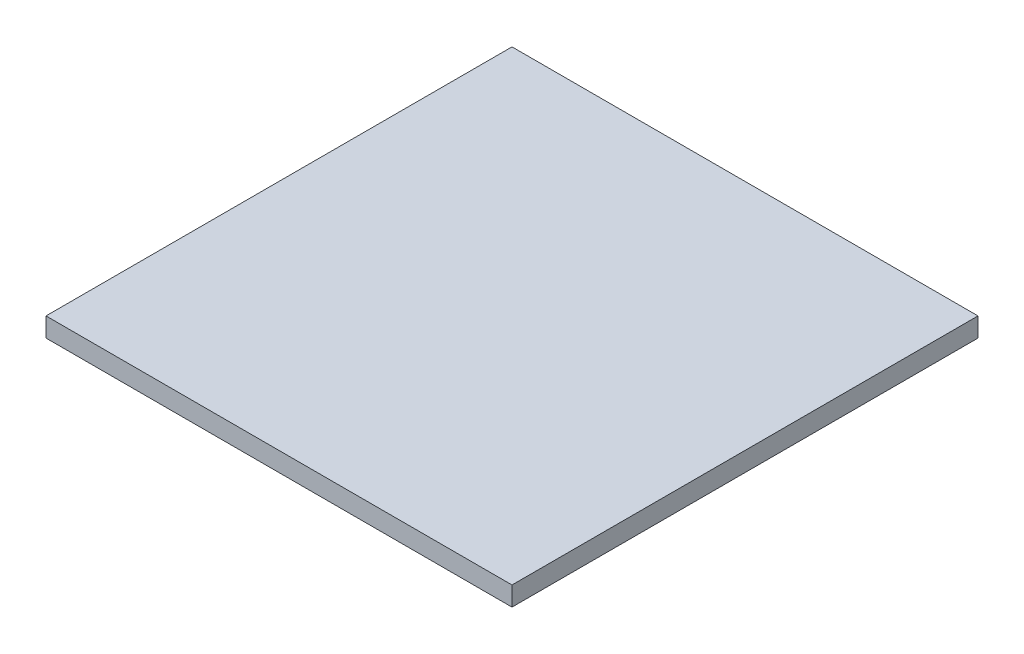
ISO-10303-21;
HEADER;
FILE_DESCRIPTION(('STEP AP214'),'2;1');
FILE_NAME('part.step','',(''),(''),'','','');
FILE_SCHEMA(('AUTOMOTIVE_DESIGN { 1 0 10303 214 1 1 1 1 }'));
ENDSEC;
DATA;
#1=APPLICATION_CONTEXT('core data for automotive mechanical design processes');
#2=APPLICATION_PROTOCOL_DEFINITION('international standard','automotive_design',2000,#1);
#3=PRODUCT_CONTEXT('',#1,'mechanical');
#4=PRODUCT('Part','Part','',(#3));
#5=PRODUCT_RELATED_PRODUCT_CATEGORY('part','',(#4));
#6=PRODUCT_DEFINITION_FORMATION('','',#4);
#7=PRODUCT_DEFINITION_CONTEXT('part definition',#1,'design');
#8=PRODUCT_DEFINITION('design','',#6,#7);
#9=PRODUCT_DEFINITION_SHAPE('','',#8);
#10=(LENGTH_UNIT() NAMED_UNIT(*) SI_UNIT(.MILLI.,.METRE.));
#11=(NAMED_UNIT(*) PLANE_ANGLE_UNIT() SI_UNIT($,.RADIAN.));
#12=(NAMED_UNIT(*) SI_UNIT($,.STERADIAN.) SOLID_ANGLE_UNIT());
#13=UNCERTAINTY_MEASURE_WITH_UNIT(LENGTH_MEASURE(1.E-05),#10,'distance_accuracy_value','');
#14=(GEOMETRIC_REPRESENTATION_CONTEXT(3) GLOBAL_UNCERTAINTY_ASSIGNED_CONTEXT((#13)) GLOBAL_UNIT_ASSIGNED_CONTEXT((#10,
#11,#12)) REPRESENTATION_CONTEXT('',''));
#15=CARTESIAN_POINT('',(0.,0.,0.));
#16=DIRECTION('',(0.,0.,1.));
#17=DIRECTION('',(1.,0.,0.));
#18=AXIS2_PLACEMENT_3D('',#15,#16,#17);
#19=CARTESIAN_POINT('',(-38.5,3.175,-38.5));
#20=DIRECTION('',(1.,0.,0.));
#21=DIRECTION('',(0.,0.,-1.));
#22=AXIS2_PLACEMENT_3D('',#19,#20,#21);
#23=PLANE('',#22);
#24=DIRECTION('',(0.,0.,1.));
#25=VECTOR('',#24,1.);
#26=CARTESIAN_POINT('',(-38.5,0.,-38.5));
#27=LINE('',#26,#25);
#28=CARTESIAN_POINT('',(-38.5,0.,-38.5));
#29=VERTEX_POINT('',#28);
#30=CARTESIAN_POINT('',(-38.5,0.,38.5));
#31=VERTEX_POINT('',#30);
#32=EDGE_CURVE('E107',#29,#31,#27,.T.);
#33=ORIENTED_EDGE('',*,*,#32,.T.);
#34=DIRECTION('',(0.,-1.,0.));
#35=VECTOR('',#34,1.);
#36=CARTESIAN_POINT('',(-38.5,3.175,38.5));
#37=LINE('',#36,#35);
#38=CARTESIAN_POINT('',(-38.5,3.175,38.5));
#39=VERTEX_POINT('',#38);
#40=EDGE_CURVE('E11',#39,#31,#37,.T.);
#41=ORIENTED_EDGE('',*,*,#40,.F.);
#42=DIRECTION('',(0.,0.,1.));
#43=VECTOR('',#42,1.);
#44=CARTESIAN_POINT('',(-38.5,3.175,-38.5));
#45=LINE('',#44,#43);
#46=CARTESIAN_POINT('',(-38.5,3.175,-38.5));
#47=VERTEX_POINT('',#46);
#48=EDGE_CURVE('E91',#47,#39,#45,.T.);
#49=ORIENTED_EDGE('',*,*,#48,.F.);
#50=DIRECTION('',(0.,-1.,0.));
#51=VECTOR('',#50,1.);
#52=CARTESIAN_POINT('',(-38.5,3.175,-38.5));
#53=LINE('',#52,#51);
#54=EDGE_CURVE('E103',#47,#29,#53,.T.);
#55=ORIENTED_EDGE('',*,*,#54,.T.);
#56=EDGE_LOOP('',(#33,#41,#49,#55));
#57=FACE_BOUND('',#56,.T.);
#58=ADVANCED_FACE('F39',(#57),#23,.F.);
#59=CARTESIAN_POINT('',(-38.5,3.175,38.5));
#60=DIRECTION('',(0.,0.,-1.));
#61=DIRECTION('',(-1.,0.,0.));
#62=AXIS2_PLACEMENT_3D('',#59,#60,#61);
#63=PLANE('',#62);
#64=DIRECTION('',(1.,0.,0.));
#65=VECTOR('',#64,1.);
#66=CARTESIAN_POINT('',(-38.5,0.,38.5));
#67=LINE('',#66,#65);
#68=CARTESIAN_POINT('',(38.5,0.,38.5));
#69=VERTEX_POINT('',#68);
#70=EDGE_CURVE('E96',#31,#69,#67,.T.);
#71=ORIENTED_EDGE('',*,*,#70,.T.);
#72=DIRECTION('',(0.,-1.,0.));
#73=VECTOR('',#72,1.);
#74=CARTESIAN_POINT('',(38.5,3.175,38.5));
#75=LINE('',#74,#73);
#76=CARTESIAN_POINT('',(38.5,3.175,38.5));
#77=VERTEX_POINT('',#76);
#78=EDGE_CURVE('E48',#77,#69,#75,.T.);
#79=ORIENTED_EDGE('',*,*,#78,.F.);
#80=DIRECTION('',(1.,0.,0.));
#81=VECTOR('',#80,1.);
#82=CARTESIAN_POINT('',(-38.5,3.175,38.5));
#83=LINE('',#82,#81);
#84=EDGE_CURVE('E86',#39,#77,#83,.T.);
#85=ORIENTED_EDGE('',*,*,#84,.F.);
#86=ORIENTED_EDGE('',*,*,#40,.T.);
#87=EDGE_LOOP('',(#71,#79,#85,#86));
#88=FACE_BOUND('',#87,.T.);
#89=ADVANCED_FACE('F95',(#88),#63,.F.);
#90=CARTESIAN_POINT('',(38.5,3.175,-38.5));
#91=DIRECTION('',(-1.,0.,0.));
#92=DIRECTION('',(0.,0.,1.));
#93=AXIS2_PLACEMENT_3D('',#90,#91,#92);
#94=PLANE('',#93);
#95=DIRECTION('',(0.,0.,-1.));
#96=VECTOR('',#95,1.);
#97=CARTESIAN_POINT('',(38.5,0.,-38.5));
#98=LINE('',#97,#96);
#99=CARTESIAN_POINT('',(38.5,0.,-38.5));
#100=VERTEX_POINT('',#99);
#101=EDGE_CURVE('E73',#69,#100,#98,.T.);
#102=ORIENTED_EDGE('',*,*,#101,.T.);
#103=DIRECTION('',(0.,-1.,0.));
#104=VECTOR('',#103,1.);
#105=CARTESIAN_POINT('',(38.5,3.175,-38.5));
#106=LINE('',#105,#104);
#107=CARTESIAN_POINT('',(38.5,3.175,-38.5));
#108=VERTEX_POINT('',#107);
#109=EDGE_CURVE('E98',#108,#100,#106,.T.);
#110=ORIENTED_EDGE('',*,*,#109,.F.);
#111=DIRECTION('',(0.,0.,-1.));
#112=VECTOR('',#111,1.);
#113=CARTESIAN_POINT('',(38.5,3.175,-38.5));
#114=LINE('',#113,#112);
#115=EDGE_CURVE('E89',#77,#108,#114,.T.);
#116=ORIENTED_EDGE('',*,*,#115,.F.);
#117=ORIENTED_EDGE('',*,*,#78,.T.);
#118=EDGE_LOOP('',(#102,#110,#116,#117));
#119=FACE_BOUND('',#118,.T.);
#120=ADVANCED_FACE('F99',(#119),#94,.F.);
#121=CARTESIAN_POINT('',(-38.5,3.175,-38.5));
#122=DIRECTION('',(0.,0.,1.));
#123=DIRECTION('',(1.,0.,0.));
#124=AXIS2_PLACEMENT_3D('',#121,#122,#123);
#125=PLANE('',#124);
#126=DIRECTION('',(-1.,0.,0.));
#127=VECTOR('',#126,1.);
#128=CARTESIAN_POINT('',(-38.5,0.,-38.5));
#129=LINE('',#128,#127);
#130=EDGE_CURVE('E79',#100,#29,#129,.T.);
#131=ORIENTED_EDGE('',*,*,#130,.T.);
#132=ORIENTED_EDGE('',*,*,#54,.F.);
#133=DIRECTION('',(-1.,0.,0.));
#134=VECTOR('',#133,1.);
#135=CARTESIAN_POINT('',(-38.5,3.175,-38.5));
#136=LINE('',#135,#134);
#137=EDGE_CURVE('E56',#108,#47,#136,.T.);
#138=ORIENTED_EDGE('',*,*,#137,.F.);
#139=ORIENTED_EDGE('',*,*,#109,.T.);
#140=EDGE_LOOP('',(#131,#132,#138,#139));
#141=FACE_BOUND('',#140,.T.);
#142=ADVANCED_FACE('F120',(#141),#125,.F.);
#143=CARTESIAN_POINT('',(0.,3.175,0.));
#144=DIRECTION('',(0.,1.,0.));
#145=DIRECTION('',(0.,0.,1.));
#146=AXIS2_PLACEMENT_3D('',#143,#144,#145);
#147=PLANE('',#146);
#148=ORIENTED_EDGE('',*,*,#48,.T.);
#149=ORIENTED_EDGE('',*,*,#84,.T.);
#150=ORIENTED_EDGE('',*,*,#115,.T.);
#151=ORIENTED_EDGE('',*,*,#137,.T.);
#152=EDGE_LOOP('',(#148,#149,#150,#151));
#153=FACE_BOUND('',#152,.T.);
#154=ADVANCED_FACE('F87',(#153),#147,.T.);
#155=CARTESIAN_POINT('',(0.,0.,0.));
#156=DIRECTION('',(0.,1.,0.));
#157=DIRECTION('',(0.,0.,1.));
#158=AXIS2_PLACEMENT_3D('',#155,#156,#157);
#159=PLANE('',#158);
#160=ORIENTED_EDGE('',*,*,#32,.F.);
#161=ORIENTED_EDGE('',*,*,#130,.F.);
#162=ORIENTED_EDGE('',*,*,#101,.F.);
#163=ORIENTED_EDGE('',*,*,#70,.F.);
#164=EDGE_LOOP('',(#160,#161,#162,#163));
#165=FACE_BOUND('',#164,.T.);
#166=ADVANCED_FACE('F123',(#165),#159,.F.);
#167=CLOSED_SHELL('',(#58,#89,#120,#142,#154,#166));
#168=MANIFOLD_SOLID_BREP('B2',#167);
#169=ADVANCED_BREP_SHAPE_REPRESENTATION('',(#18,#168),#14);
#170=SHAPE_DEFINITION_REPRESENTATION(#9,#169);
ENDSEC;
END-ISO-10303-21;
